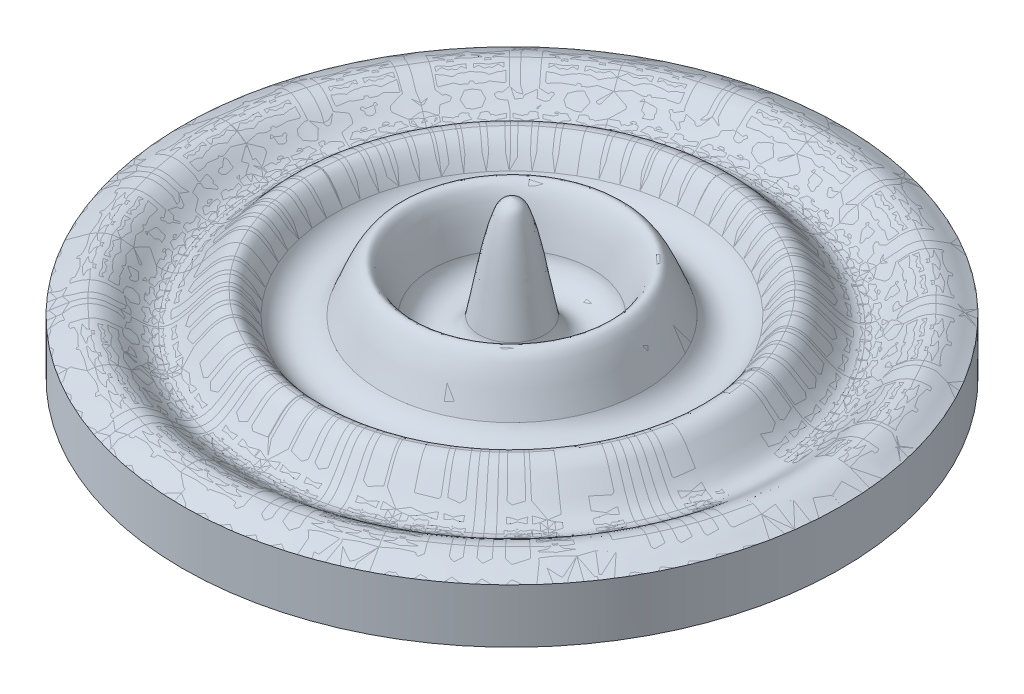
ISO-10303-21;
HEADER;
FILE_DESCRIPTION(('STEP AP214'),'2;1');
FILE_NAME('part.step','',(''),(''),'','','');
FILE_SCHEMA(('AUTOMOTIVE_DESIGN { 1 0 10303 214 1 1 1 1 }'));
ENDSEC;
DATA;
#1=APPLICATION_CONTEXT('core data for automotive mechanical design processes');
#2=APPLICATION_PROTOCOL_DEFINITION('international standard','automotive_design',2000,#1);
#3=PRODUCT_CONTEXT('',#1,'mechanical');
#4=PRODUCT('Part','Part','',(#3));
#5=PRODUCT_RELATED_PRODUCT_CATEGORY('part','',(#4));
#6=PRODUCT_DEFINITION_FORMATION('','',#4);
#7=PRODUCT_DEFINITION_CONTEXT('part definition',#1,'design');
#8=PRODUCT_DEFINITION('design','',#6,#7);
#9=PRODUCT_DEFINITION_SHAPE('','',#8);
#10=(LENGTH_UNIT() NAMED_UNIT(*) SI_UNIT(.MILLI.,.METRE.));
#11=(NAMED_UNIT(*) PLANE_ANGLE_UNIT() SI_UNIT($,.RADIAN.));
#12=(NAMED_UNIT(*) SI_UNIT($,.STERADIAN.) SOLID_ANGLE_UNIT());
#13=UNCERTAINTY_MEASURE_WITH_UNIT(LENGTH_MEASURE(1.E-05),#10,'distance_accuracy_value','');
#14=(GEOMETRIC_REPRESENTATION_CONTEXT(3) GLOBAL_UNCERTAINTY_ASSIGNED_CONTEXT((#13)) GLOBAL_UNIT_ASSIGNED_CONTEXT((#10,
#11,#12)) REPRESENTATION_CONTEXT('',''));
#15=CARTESIAN_POINT('',(0.,0.,0.));
#16=DIRECTION('',(0.,0.,1.));
#17=DIRECTION('',(1.,0.,0.));
#18=AXIS2_PLACEMENT_3D('',#15,#16,#17);
#19=CARTESIAN_POINT('',(-0.63500000039285,-12.065,0.));
#20=DIRECTION('',(0.,1.,0.));
#21=DIRECTION('',(0.,0.,1.));
#22=AXIS2_PLACEMENT_3D('',#19,#20,#21);
#23=CYLINDRICAL_SURFACE('',#22,26.034999999805);
#24=CARTESIAN_POINT('',(-0.63500000039285,-12.065,0.));
#25=DIRECTION('',(0.,1.,0.));
#26=DIRECTION('',(0.,0.,1.));
#27=AXIS2_PLACEMENT_3D('',#24,#25,#26);
#28=CIRCLE('',#27,26.034999999805);
#29=CARTESIAN_POINT('',(-0.63500000039285,-12.065,26.034999999805));
#30=VERTEX_POINT('',#29);
#31=EDGE_CURVE('E12',#30,#30,#28,.T.);
#32=ORIENTED_EDGE('',*,*,#31,.T.);
#33=EDGE_LOOP('',(#32));
#34=FACE_BOUND('',#33,.T.);
#35=CARTESIAN_POINT('',(-0.63500000039285,-7.79264529875055,0.));
#36=DIRECTION('',(0.,-1.,0.));
#37=DIRECTION('',(1.,0.,0.));
#38=AXIS2_PLACEMENT_3D('',#35,#36,#37);
#39=CIRCLE('',#38,26.034999999805);
#40=CARTESIAN_POINT('',(25.3999999994121,-7.79264529875054,0.));
#41=VERTEX_POINT('',#40);
#42=EDGE_CURVE('E86',#41,#41,#39,.T.);
#43=ORIENTED_EDGE('',*,*,#42,.T.);
#44=EDGE_LOOP('',(#43));
#45=FACE_BOUND('',#44,.T.);
#46=ADVANCED_FACE('F51',(#34,#45),#23,.T.);
#47=CARTESIAN_POINT('',(-0.63500000039285,-12.065,0.));
#48=DIRECTION('',(0.,1.,0.));
#49=DIRECTION('',(0.,0.,1.));
#50=AXIS2_PLACEMENT_3D('',#47,#48,#49);
#51=PLANE('',#50);
#52=ORIENTED_EDGE('',*,*,#31,.F.);
#53=EDGE_LOOP('',(#52));
#54=FACE_BOUND('',#53,.T.);
#55=ADVANCED_FACE('F75',(#54),#51,.F.);
#56=CARTESIAN_POINT('',(13.3881588416213,-7.79264529875055,0.));
#57=CARTESIAN_POINT('',(13.6331144923353,-7.38770645667432,0.));
#58=CARTESIAN_POINT('',(14.0432178665685,-6.70255354405692,0.));
#59=CARTESIAN_POINT('',(14.9448260700997,-5.7906703482024,0.));
#60=CARTESIAN_POINT('',(16.1085651905665,-6.14512948130187,0.));
#61=CARTESIAN_POINT('',(16.8307676073786,-7.03568118305396,0.));
#62=CARTESIAN_POINT('',(17.6353740898879,-7.96814473383845,0.));
#63=CARTESIAN_POINT('',(18.4383286225971,-8.69929102195063,0.));
#64=CARTESIAN_POINT('',(19.430653758325,-8.83272851241775,0.));
#65=CARTESIAN_POINT('',(20.3388793083131,-8.33503949258835,0.));
#66=CARTESIAN_POINT('',(21.1690042638224,-7.62285834045956,0.));
#67=CARTESIAN_POINT('',(22.0464993491437,-7.00261713412384,0.));
#68=CARTESIAN_POINT('',(22.9803093561406,-6.75639863721273,0.));
#69=CARTESIAN_POINT('',(24.1433212001958,-7.0510587864965,0.));
#70=CARTESIAN_POINT('',(24.8744345265186,-7.54837004202804,0.));
#71=CARTESIAN_POINT('',(25.3999999994121,-7.79264529875054,0.));
#72=B_SPLINE_CURVE_WITH_KNOTS('',3,(#56,#57,#58,#59,#60,#61,#62,#63,#64,#65,#66,#67,#68,#69,#70,
#71),.UNSPECIFIED.,.F.,.F.,(4,1,1,1,1,1,1,1,1,1,1,1,1,4),(0.,0.0954166381263903,
0.173939639511957,0.230301116660233,0.319564115412288,0.405971471710571,0.486207163321331,
0.533899042793011,0.600954030801603,0.689611596021994,0.760955253094878,0.81936974637203,
0.88123828203234,1.),.UNSPECIFIED.);
#73=CARTESIAN_POINT('',(-0.635000000392851,1.02333630952504,0.));
#74=DIRECTION('',(0.,-1.,0.));
#75=AXIS1_PLACEMENT('',#73,#74);
#76=SURFACE_OF_REVOLUTION('',#72,#75);
#77=ORIENTED_EDGE('',*,*,#42,.F.);
#78=EDGE_LOOP('',(#77));
#79=FACE_BOUND('',#78,.T.);
#80=CARTESIAN_POINT('',(-0.63500000039285,-7.79264529875055,0.));
#81=DIRECTION('',(0.,-1.,0.));
#82=DIRECTION('',(1.,0.,0.));
#83=AXIS2_PLACEMENT_3D('',#80,#81,#82);
#84=CIRCLE('',#83,14.0231588420141);
#85=CARTESIAN_POINT('',(13.3881588416213,-7.79264529875054,0.));
#86=VERTEX_POINT('',#85);
#87=EDGE_CURVE('E89',#86,#86,#84,.T.);
#88=ORIENTED_EDGE('',*,*,#87,.T.);
#89=EDGE_LOOP('',(#88));
#90=FACE_BOUND('',#89,.T.);
#91=ADVANCED_FACE('F80',(#79,#90),#76,.T.);
#92=CARTESIAN_POINT('',(-0.635000000392849,-6.63493613364697,0.));
#93=DIRECTION('',(0.,-1.,0.));
#94=DIRECTION('',(1.,0.,0.));
#95=AXIS2_PLACEMENT_3D('',#92,#93,#94);
#96=TOROIDAL_SURFACE('',#95,12.1839047425766,2.17328004483142);
#97=ORIENTED_EDGE('',*,*,#87,.F.);
#98=EDGE_LOOP('',(#97));
#99=FACE_BOUND('',#98,.T.);
#100=CARTESIAN_POINT('',(-0.63500000039285,-7.79264529875055,0.));
#101=DIRECTION('',(0.,-1.,0.));
#102=DIRECTION('',(1.,0.,0.));
#103=AXIS2_PLACEMENT_3D('',#100,#101,#102);
#104=CIRCLE('',#103,10.3446506431391);
#105=CARTESIAN_POINT('',(9.70965064274629,-7.79264529875055,0.));
#106=VERTEX_POINT('',#105);
#107=EDGE_CURVE('E93',#106,#106,#104,.T.);
#108=ORIENTED_EDGE('',*,*,#107,.T.);
#109=EDGE_LOOP('',(#108));
#110=FACE_BOUND('',#109,.T.);
#111=ADVANCED_FACE('F124',(#99,#110),#96,.F.);
#112=CARTESIAN_POINT('',(5.7334878673665,-7.79264529875054,0.));
#113=CARTESIAN_POINT('',(5.93962258444673,-7.0702936446259,0.));
#114=CARTESIAN_POINT('',(6.25326169631791,-5.97437260516197,0.));
#115=CARTESIAN_POINT('',(6.75934058783432,-4.75445276624926,0.));
#116=CARTESIAN_POINT('',(7.14565836577248,-4.19229132721482,0.));
#117=CARTESIAN_POINT('',(7.52365000293536,-3.97001778813751,0.));
#118=CARTESIAN_POINT('',(7.81300899894348,-4.08600166372514,0.));
#119=CARTESIAN_POINT('',(8.07548780477474,-4.30648707786497,0.));
#120=CARTESIAN_POINT('',(8.22771099831312,-4.49770877302516,0.));
#121=CARTESIAN_POINT('',(8.96679450350177,-5.79168020874922,0.));
#122=CARTESIAN_POINT('',(9.2902396019076,-6.8341614279451,0.));
#123=CARTESIAN_POINT('',(9.70965064274628,-7.79264529875054,0.));
#124=B_SPLINE_CURVE_WITH_KNOTS('',3,(#112,#113,#114,#115,#116,#117,#118,#119,#120,#121,#122,
#123),.UNSPECIFIED.,.F.,.F.,(4,1,1,1,1,1,1,1,1,4),(0.,0.287290646436154,0.437609144279893,
0.502202855758723,0.547626845696385,0.592379005997708,0.606959939993701,0.683827713916019,
0.715332316398656,1.),.UNSPECIFIED.);
#125=CARTESIAN_POINT('',(-0.635000000392851,1.02333630952504,0.));
#126=DIRECTION('',(0.,-1.,0.));
#127=AXIS1_PLACEMENT('',#125,#126);
#128=SURFACE_OF_REVOLUTION('',#124,#127);
#129=ORIENTED_EDGE('',*,*,#107,.F.);
#130=EDGE_LOOP('',(#129));
#131=FACE_BOUND('',#130,.T.);
#132=CARTESIAN_POINT('',(-0.63500000039285,-7.79264529875054,0.));
#133=DIRECTION('',(0.,-1.,0.));
#134=DIRECTION('',(1.,0.,0.));
#135=AXIS2_PLACEMENT_3D('',#132,#133,#134);
#136=CIRCLE('',#135,6.36848786775935);
#137=CARTESIAN_POINT('',(5.7334878673665,-7.79264529875054,0.));
#138=VERTEX_POINT('',#137);
#139=EDGE_CURVE('E98',#138,#138,#136,.T.);
#140=ORIENTED_EDGE('',*,*,#139,.T.);
#141=EDGE_LOOP('',(#140));
#142=FACE_BOUND('',#141,.T.);
#143=ADVANCED_FACE('F69',(#131,#142),#128,.T.);
#144=CARTESIAN_POINT('',(-0.63500000039285,-7.42291421459553,0.));
#145=DIRECTION('',(0.,-1.,0.));
#146=DIRECTION('',(1.,0.,0.));
#147=AXIS2_PLACEMENT_3D('',#144,#145,#146);
#148=TOROIDAL_SURFACE('',#147,4.48232944476944,1.92205480442317);
#149=ORIENTED_EDGE('',*,*,#139,.F.);
#150=EDGE_LOOP('',(#149));
#151=FACE_BOUND('',#150,.T.);
#152=CARTESIAN_POINT('',(-0.63500000039285,-7.79264529875054,0.));
#153=DIRECTION('',(0.,-1.,0.));
#154=DIRECTION('',(1.,0.,0.));
#155=AXIS2_PLACEMENT_3D('',#152,#153,#154);
#156=CIRCLE('',#155,2.59617102177954);
#157=CARTESIAN_POINT('',(1.96117102138669,-7.79264529875054,0.));
#158=VERTEX_POINT('',#157);
#159=EDGE_CURVE('E58',#158,#158,#156,.T.);
#160=ORIENTED_EDGE('',*,*,#159,.T.);
#161=EDGE_LOOP('',(#160));
#162=FACE_BOUND('',#161,.T.);
#163=ADVANCED_FACE('F63',(#151,#162),#148,.F.);
#164=CARTESIAN_POINT('',(-0.635000000392851,0.30833255158621,0.));
#165=CARTESIAN_POINT('',(-0.093644886628534,0.145263859725363,0.));
#166=CARTESIAN_POINT('',(0.166355748975789,-0.0823837133000469,0.));
#167=CARTESIAN_POINT('',(0.491164808329863,-0.918302166405736,0.));
#168=CARTESIAN_POINT('',(0.994887367615505,-2.58854025869084,0.));
#169=CARTESIAN_POINT('',(1.41775407461104,-4.98299558332943,0.));
#170=CARTESIAN_POINT('',(1.81130036499806,-7.00129441202844,0.));
#171=CARTESIAN_POINT('',(1.96117102138669,-7.79264529875054,0.));
#172=B_SPLINE_CURVE_WITH_KNOTS('',3,(#164,#165,#166,#167,#168,#169,#170,#171),.UNSPECIFIED.,.F.,
.F.,(4,1,1,1,1,4),(0.,0.148488905180841,0.179153267599385,0.306643624185433,0.729297930738532,
1.),.UNSPECIFIED.);
#173=CARTESIAN_POINT('',(-0.635000000392851,1.02333630952504,0.));
#174=DIRECTION('',(0.,-1.,0.));
#175=AXIS1_PLACEMENT('',#173,#174);
#176=SURFACE_OF_REVOLUTION('',#172,#175);
#177=ORIENTED_EDGE('',*,*,#159,.F.);
#178=EDGE_LOOP('',(#177));
#179=FACE_BOUND('',#178,.T.);
#180=CARTESIAN_POINT('',(-0.635000000392851,0.30833255158621,0.));
#181=VERTEX_POINT('',#180);
#182=VERTEX_LOOP('',#181);
#183=FACE_BOUND('',#182,.T.);
#184=ADVANCED_FACE('F61',(#179,#183),#176,.T.);
#185=CLOSED_SHELL('',(#46,#55,#91,#111,#143,#163,#184));
#186=MANIFOLD_SOLID_BREP('B2',#185);
#187=CARTESIAN_POINT('',(13.3881588416213,-7.79264529875055,0.));
#188=CARTESIAN_POINT('',(13.6331144923353,-7.38770645667432,0.));
#189=CARTESIAN_POINT('',(14.0432178665685,-6.70255354405692,0.));
#190=CARTESIAN_POINT('',(14.9448260700997,-5.7906703482024,0.));
#191=CARTESIAN_POINT('',(16.1085651905665,-6.14512948130187,0.));
#192=CARTESIAN_POINT('',(16.8307676073786,-7.03568118305396,0.));
#193=CARTESIAN_POINT('',(17.6353740898879,-7.96814473383845,0.));
#194=CARTESIAN_POINT('',(18.4383286225971,-8.69929102195063,0.));
#195=CARTESIAN_POINT('',(19.430653758325,-8.83272851241775,0.));
#196=CARTESIAN_POINT('',(20.3388793083131,-8.33503949258835,0.));
#197=CARTESIAN_POINT('',(21.1690042638224,-7.62285834045956,0.));
#198=CARTESIAN_POINT('',(22.0464993491437,-7.00261713412384,0.));
#199=CARTESIAN_POINT('',(22.9803093561406,-6.75639863721273,0.));
#200=CARTESIAN_POINT('',(24.1433212001958,-7.0510587864965,0.));
#201=CARTESIAN_POINT('',(24.8744345265186,-7.54837004202804,0.));
#202=CARTESIAN_POINT('',(25.3999999994121,-7.79264529875054,0.));
#203=B_SPLINE_CURVE_WITH_KNOTS('',3,(#187,#188,#189,#190,#191,#192,#193,#194,#195,#196,#197,
#198,#199,#200,#201,#202),.UNSPECIFIED.,.F.,.F.,(4,1,1,1,1,1,1,1,1,1,1,1,1,4),(0.,
0.0954166381263903,0.173939639511957,0.230301116660233,0.319564115412288,0.405971471710571,
0.486207163321331,0.533899042793011,0.600954030801603,0.689611596021994,0.760955253094878,
0.81936974637203,0.88123828203234,1.),.UNSPECIFIED.);
#204=CARTESIAN_POINT('',(-0.635000000392851,1.02333630952504,0.));
#205=DIRECTION('',(0.,-1.,0.));
#206=AXIS1_PLACEMENT('',#204,#205);
#207=SURFACE_OF_REVOLUTION('',#203,#206);
#208=CARTESIAN_POINT('',(-0.63500000039285,-7.79264529875055,0.));
#209=DIRECTION('',(0.,-1.,0.));
#210=DIRECTION('',(1.,0.,0.));
#211=AXIS2_PLACEMENT_3D('',#208,#209,#210);
#212=CIRCLE('',#211,26.034999999805);
#213=CARTESIAN_POINT('',(25.3999999994121,-7.79264529875054,0.));
#214=VERTEX_POINT('',#213);
#215=EDGE_CURVE('E49',#214,#214,#212,.T.);
#216=ORIENTED_EDGE('',*,*,#215,.T.);
#217=EDGE_LOOP('',(#216));
#218=FACE_BOUND('',#217,.T.);
#219=CARTESIAN_POINT('',(-0.63500000039285,-7.79264529875055,0.));
#220=DIRECTION('',(0.,-1.,0.));
#221=DIRECTION('',(1.,0.,0.));
#222=AXIS2_PLACEMENT_3D('',#219,#220,#221);
#223=CIRCLE('',#222,14.0231588420141);
#224=CARTESIAN_POINT('',(13.3881588416213,-7.79264529875054,0.));
#225=VERTEX_POINT('',#224);
#226=EDGE_CURVE('E184',#225,#225,#223,.T.);
#227=ORIENTED_EDGE('',*,*,#226,.F.);
#228=EDGE_LOOP('',(#227));
#229=FACE_BOUND('',#228,.T.);
#230=ADVANCED_FACE('F181',(#218,#229),#207,.F.);
#231=CARTESIAN_POINT('',(-0.635000000392849,-6.63493613364697,0.));
#232=DIRECTION('',(0.,-1.,0.));
#233=DIRECTION('',(1.,0.,0.));
#234=AXIS2_PLACEMENT_3D('',#231,#232,#233);
#235=TOROIDAL_SURFACE('',#234,12.1839047425766,2.17328004483142);
#236=ORIENTED_EDGE('',*,*,#226,.T.);
#237=EDGE_LOOP('',(#236));
#238=FACE_BOUND('',#237,.T.);
#239=CARTESIAN_POINT('',(-0.63500000039285,-7.79264529875055,0.));
#240=DIRECTION('',(0.,-1.,0.));
#241=DIRECTION('',(1.,0.,0.));
#242=AXIS2_PLACEMENT_3D('',#239,#240,#241);
#243=CIRCLE('',#242,10.3446506431391);
#244=CARTESIAN_POINT('',(9.70965064274629,-7.79264529875055,0.));
#245=VERTEX_POINT('',#244);
#246=EDGE_CURVE('E220',#245,#245,#243,.T.);
#247=ORIENTED_EDGE('',*,*,#246,.F.);
#248=EDGE_LOOP('',(#247));
#249=FACE_BOUND('',#248,.T.);
#250=ADVANCED_FACE('F227',(#238,#249),#235,.T.);
#251=CARTESIAN_POINT('',(5.7334878673665,-7.79264529875054,0.));
#252=CARTESIAN_POINT('',(5.93962258444673,-7.0702936446259,0.));
#253=CARTESIAN_POINT('',(6.25326169631791,-5.97437260516197,0.));
#254=CARTESIAN_POINT('',(6.75934058783432,-4.75445276624926,0.));
#255=CARTESIAN_POINT('',(7.14565836577248,-4.19229132721482,0.));
#256=CARTESIAN_POINT('',(7.52365000293536,-3.97001778813751,0.));
#257=CARTESIAN_POINT('',(7.81300899894348,-4.08600166372514,0.));
#258=CARTESIAN_POINT('',(8.07548780477474,-4.30648707786497,0.));
#259=CARTESIAN_POINT('',(8.22771099831312,-4.49770877302516,0.));
#260=CARTESIAN_POINT('',(8.96679450350177,-5.79168020874922,0.));
#261=CARTESIAN_POINT('',(9.2902396019076,-6.8341614279451,0.));
#262=CARTESIAN_POINT('',(9.70965064274628,-7.79264529875054,0.));
#263=B_SPLINE_CURVE_WITH_KNOTS('',3,(#251,#252,#253,#254,#255,#256,#257,#258,#259,#260,#261,
#262),.UNSPECIFIED.,.F.,.F.,(4,1,1,1,1,1,1,1,1,4),(0.,0.287290646436154,0.437609144279893,
0.502202855758723,0.547626845696385,0.592379005997708,0.606959939993701,0.683827713916019,
0.715332316398656,1.),.UNSPECIFIED.);
#264=CARTESIAN_POINT('',(-0.635000000392851,1.02333630952504,0.));
#265=DIRECTION('',(0.,-1.,0.));
#266=AXIS1_PLACEMENT('',#264,#265);
#267=SURFACE_OF_REVOLUTION('',#263,#266);
#268=ORIENTED_EDGE('',*,*,#246,.T.);
#269=EDGE_LOOP('',(#268));
#270=FACE_BOUND('',#269,.T.);
#271=CARTESIAN_POINT('',(-0.63500000039285,-7.79264529875054,0.));
#272=DIRECTION('',(0.,-1.,0.));
#273=DIRECTION('',(1.,0.,0.));
#274=AXIS2_PLACEMENT_3D('',#271,#272,#273);
#275=CIRCLE('',#274,6.36848786775935);
#276=CARTESIAN_POINT('',(5.7334878673665,-7.79264529875054,0.));
#277=VERTEX_POINT('',#276);
#278=EDGE_CURVE('E217',#277,#277,#275,.T.);
#279=ORIENTED_EDGE('',*,*,#278,.F.);
#280=EDGE_LOOP('',(#279));
#281=FACE_BOUND('',#280,.T.);
#282=ADVANCED_FACE('F198',(#270,#281),#267,.F.);
#283=CARTESIAN_POINT('',(-0.63500000039285,-7.42291421459553,0.));
#284=DIRECTION('',(0.,-1.,0.));
#285=DIRECTION('',(1.,0.,0.));
#286=AXIS2_PLACEMENT_3D('',#283,#284,#285);
#287=TOROIDAL_SURFACE('',#286,4.48232944476944,1.92205480442317);
#288=ORIENTED_EDGE('',*,*,#278,.T.);
#289=EDGE_LOOP('',(#288));
#290=FACE_BOUND('',#289,.T.);
#291=CARTESIAN_POINT('',(-0.63500000039285,-7.79264529875054,0.));
#292=DIRECTION('',(0.,-1.,0.));
#293=DIRECTION('',(1.,0.,0.));
#294=AXIS2_PLACEMENT_3D('',#291,#292,#293);
#295=CIRCLE('',#294,2.59617102177954);
#296=CARTESIAN_POINT('',(1.96117102138669,-7.79264529875054,0.));
#297=VERTEX_POINT('',#296);
#298=EDGE_CURVE('E212',#297,#297,#295,.T.);
#299=ORIENTED_EDGE('',*,*,#298,.F.);
#300=EDGE_LOOP('',(#299));
#301=FACE_BOUND('',#300,.T.);
#302=ADVANCED_FACE('F192',(#290,#301),#287,.T.);
#303=CARTESIAN_POINT('',(-0.635000000392851,0.30833255158621,0.));
#304=CARTESIAN_POINT('',(-0.093644886628534,0.145263859725363,0.));
#305=CARTESIAN_POINT('',(0.166355748975789,-0.0823837133000469,0.));
#306=CARTESIAN_POINT('',(0.491164808329863,-0.918302166405736,0.));
#307=CARTESIAN_POINT('',(0.994887367615505,-2.58854025869084,0.));
#308=CARTESIAN_POINT('',(1.41775407461104,-4.98299558332943,0.));
#309=CARTESIAN_POINT('',(1.81130036499806,-7.00129441202844,0.));
#310=CARTESIAN_POINT('',(1.96117102138669,-7.79264529875054,0.));
#311=B_SPLINE_CURVE_WITH_KNOTS('',3,(#303,#304,#305,#306,#307,#308,#309,#310),.UNSPECIFIED.,.F.,
.F.,(4,1,1,1,1,4),(0.,0.148488905180841,0.179153267599385,0.306643624185433,0.729297930738532,
1.),.UNSPECIFIED.);
#312=CARTESIAN_POINT('',(-0.635000000392851,1.02333630952504,0.));
#313=DIRECTION('',(0.,-1.,0.));
#314=AXIS1_PLACEMENT('',#312,#313);
#315=SURFACE_OF_REVOLUTION('',#311,#314);
#316=ORIENTED_EDGE('',*,*,#298,.T.);
#317=EDGE_LOOP('',(#316));
#318=FACE_BOUND('',#317,.T.);
#319=CARTESIAN_POINT('',(-0.635000000392851,0.30833255158621,0.));
#320=VERTEX_POINT('',#319);
#321=VERTEX_LOOP('',#320);
#322=FACE_BOUND('',#321,.T.);
#323=ADVANCED_FACE('F190',(#318,#322),#315,.F.);
#324=OPEN_SHELL('',(#230,#250,#282,#302,#323));
#325=SHELL_BASED_SURFACE_MODEL('B6',(#324));
#326=ADVANCED_BREP_SHAPE_REPRESENTATION('',(#18,#186),#14);
#327=MANIFOLD_SURFACE_SHAPE_REPRESENTATION('',(#18,#325),#14);
#328=SHAPE_REPRESENTATION('',(#18),#14);
#329=SHAPE_DEFINITION_REPRESENTATION(#9,#328);
#330=SHAPE_REPRESENTATION_RELATIONSHIP('','',#328,#326);
#331=SHAPE_REPRESENTATION_RELATIONSHIP('','',#328,#327);
ENDSEC;
END-ISO-10303-21;
